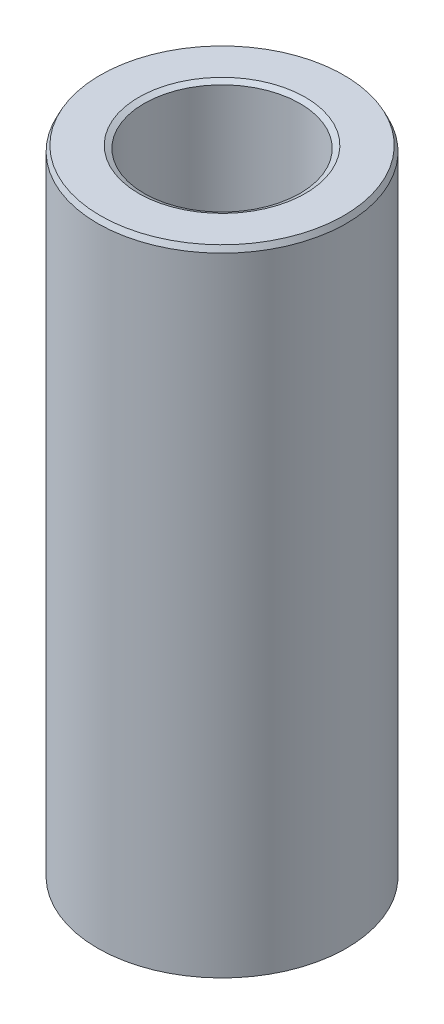
ISO-10303-21;
HEADER;
FILE_DESCRIPTION(('STEP AP214'),'2;1');
FILE_NAME('part.step','',(''),(''),'','','');
FILE_SCHEMA(('AUTOMOTIVE_DESIGN { 1 0 10303 214 1 1 1 1 }'));
ENDSEC;
DATA;
#1=APPLICATION_CONTEXT('core data for automotive mechanical design processes');
#2=APPLICATION_PROTOCOL_DEFINITION('international standard','automotive_design',2000,#1);
#3=PRODUCT_CONTEXT('',#1,'mechanical');
#4=PRODUCT('Part','Part','',(#3));
#5=PRODUCT_RELATED_PRODUCT_CATEGORY('part','',(#4));
#6=PRODUCT_DEFINITION_FORMATION('','',#4);
#7=PRODUCT_DEFINITION_CONTEXT('part definition',#1,'design');
#8=PRODUCT_DEFINITION('design','',#6,#7);
#9=PRODUCT_DEFINITION_SHAPE('','',#8);
#10=(LENGTH_UNIT() NAMED_UNIT(*) SI_UNIT(.MILLI.,.METRE.));
#11=(NAMED_UNIT(*) PLANE_ANGLE_UNIT() SI_UNIT($,.RADIAN.));
#12=(NAMED_UNIT(*) SI_UNIT($,.STERADIAN.) SOLID_ANGLE_UNIT());
#13=UNCERTAINTY_MEASURE_WITH_UNIT(LENGTH_MEASURE(1.E-05),#10,'distance_accuracy_value','');
#14=(GEOMETRIC_REPRESENTATION_CONTEXT(3) GLOBAL_UNCERTAINTY_ASSIGNED_CONTEXT((#13)) GLOBAL_UNIT_ASSIGNED_CONTEXT((#10,
#11,#12)) REPRESENTATION_CONTEXT('',''));
#15=CARTESIAN_POINT('',(0.,0.,0.));
#16=DIRECTION('',(0.,0.,1.));
#17=DIRECTION('',(1.,0.,0.));
#18=AXIS2_PLACEMENT_3D('',#15,#16,#17);
#19=CARTESIAN_POINT('',(0.,166.043960779627,0.));
#20=DIRECTION('',(0.,-1.,0.));
#21=DIRECTION('',(0.,0.,-1.));
#22=AXIS2_PLACEMENT_3D('',#19,#20,#21);
#23=CYLINDRICAL_SURFACE('',#22,32.5);
#24=CARTESIAN_POINT('',(0.,0.6985210400903,0.));
#25=DIRECTION('',(0.,1.,0.));
#26=DIRECTION('',(0.,0.,1.));
#27=AXIS2_PLACEMENT_3D('',#24,#25,#26);
#28=CIRCLE('',#27,32.5);
#29=CARTESIAN_POINT('',(0.,0.6985210400903,32.5));
#30=VERTEX_POINT('',#29);
#31=EDGE_CURVE('E10',#30,#30,#28,.T.);
#32=ORIENTED_EDGE('',*,*,#31,.T.);
#33=EDGE_LOOP('',(#32));
#34=FACE_BOUND('',#33,.T.);
#35=CARTESIAN_POINT('',(0.,164.63191108338,0.));
#36=DIRECTION('',(0.,1.,0.));
#37=DIRECTION('',(0.,0.,1.));
#38=AXIS2_PLACEMENT_3D('',#35,#36,#37);
#39=CIRCLE('',#38,32.5);
#40=CARTESIAN_POINT('',(0.,164.63191108338,32.5));
#41=VERTEX_POINT('',#40);
#42=EDGE_CURVE('E50',#41,#41,#39,.F.);
#43=ORIENTED_EDGE('',*,*,#42,.T.);
#44=EDGE_LOOP('',(#43));
#45=FACE_BOUND('',#44,.T.);
#46=ADVANCED_FACE('F39',(#34,#45),#23,.T.);
#47=CARTESIAN_POINT('',(0.,166.043960779627,0.));
#48=DIRECTION('',(0.,1.,0.));
#49=DIRECTION('',(0.,0.,1.));
#50=AXIS2_PLACEMENT_3D('',#47,#48,#49);
#51=PLANE('',#50);
#52=CARTESIAN_POINT('',(0.,166.043960779627,0.));
#53=DIRECTION('',(0.,1.,0.));
#54=DIRECTION('',(0.,0.,1.));
#55=AXIS2_PLACEMENT_3D('',#52,#53,#54);
#56=CIRCLE('',#55,21.7664873382776);
#57=CARTESIAN_POINT('',(0.,166.043960779627,21.7664873382776));
#58=VERTEX_POINT('',#57);
#59=EDGE_CURVE('E58',#58,#58,#56,.F.);
#60=ORIENTED_EDGE('',*,*,#59,.T.);
#61=EDGE_LOOP('',(#60));
#62=FACE_BOUND('',#61,.T.);
#63=CARTESIAN_POINT('',(0.,166.043960779627,0.));
#64=DIRECTION('',(0.,1.,0.));
#65=DIRECTION('',(0.,0.,1.));
#66=AXIS2_PLACEMENT_3D('',#63,#64,#65);
#67=CIRCLE('',#66,31.8014789599097);
#68=CARTESIAN_POINT('',(0.,166.043960779627,31.8014789599097));
#69=VERTEX_POINT('',#68);
#70=EDGE_CURVE('E61',#69,#69,#67,.T.);
#71=ORIENTED_EDGE('',*,*,#70,.T.);
#72=EDGE_LOOP('',(#71));
#73=FACE_BOUND('',#72,.T.);
#74=ADVANCED_FACE('F88',(#62,#73),#51,.T.);
#75=CARTESIAN_POINT('',(0.,0.,0.));
#76=DIRECTION('',(0.,1.,0.));
#77=DIRECTION('',(0.,0.,1.));
#78=AXIS2_PLACEMENT_3D('',#75,#76,#77);
#79=PLANE('',#78);
#80=CARTESIAN_POINT('',(0.,0.,0.));
#81=DIRECTION('',(0.,1.,0.));
#82=DIRECTION('',(0.,0.,1.));
#83=AXIS2_PLACEMENT_3D('',#80,#81,#82);
#84=CIRCLE('',#83,21.0529586821203);
#85=CARTESIAN_POINT('',(0.,0.,21.0529586821203));
#86=VERTEX_POINT('',#85);
#87=EDGE_CURVE('E51',#86,#86,#84,.T.);
#88=ORIENTED_EDGE('',*,*,#87,.T.);
#89=EDGE_LOOP('',(#88));
#90=FACE_BOUND('',#89,.T.);
#91=CARTESIAN_POINT('',(0.,0.,0.));
#92=DIRECTION('',(0.,1.,0.));
#93=DIRECTION('',(0.,0.,1.));
#94=AXIS2_PLACEMENT_3D('',#91,#92,#93);
#95=CIRCLE('',#94,31.0879503037524);
#96=CARTESIAN_POINT('',(0.,0.,31.0879503037524));
#97=VERTEX_POINT('',#96);
#98=EDGE_CURVE('E54',#97,#97,#95,.F.);
#99=ORIENTED_EDGE('',*,*,#98,.T.);
#100=EDGE_LOOP('',(#99));
#101=FACE_BOUND('',#100,.T.);
#102=ADVANCED_FACE('F83',(#90,#101),#79,.F.);
#103=CARTESIAN_POINT('',(0.,166.043960779627,0.));
#104=DIRECTION('',(0.,-1.,0.));
#105=DIRECTION('',(0.,0.,-1.));
#106=AXIS2_PLACEMENT_3D('',#103,#104,#105);
#107=CYLINDRICAL_SURFACE('',#106,20.35443764203);
#108=CARTESIAN_POINT('',(0.,165.345439739537,0.));
#109=DIRECTION('',(0.,1.,0.));
#110=DIRECTION('',(0.,0.,1.));
#111=AXIS2_PLACEMENT_3D('',#108,#109,#110);
#112=CIRCLE('',#111,20.35443764203);
#113=CARTESIAN_POINT('',(0.,165.345439739537,20.35443764203));
#114=VERTEX_POINT('',#113);
#115=EDGE_CURVE('E67',#114,#114,#112,.T.);
#116=ORIENTED_EDGE('',*,*,#115,.T.);
#117=EDGE_LOOP('',(#116));
#118=FACE_BOUND('',#117,.T.);
#119=CARTESIAN_POINT('',(0.,1.41204969624764,0.));
#120=DIRECTION('',(0.,1.,0.));
#121=DIRECTION('',(0.,0.,1.));
#122=AXIS2_PLACEMENT_3D('',#119,#120,#121);
#123=CIRCLE('',#122,20.35443764203);
#124=CARTESIAN_POINT('',(0.,1.41204969624764,20.35443764203));
#125=VERTEX_POINT('',#124);
#126=EDGE_CURVE('E69',#125,#125,#123,.F.);
#127=ORIENTED_EDGE('',*,*,#126,.T.);
#128=EDGE_LOOP('',(#127));
#129=FACE_BOUND('',#128,.T.);
#130=ADVANCED_FACE('F71',(#118,#129),#107,.F.);
#131=CARTESIAN_POINT('',(0.,165.345439739537,0.));
#132=DIRECTION('',(0.,1.,0.));
#133=DIRECTION('',(0.,0.,1.));
#134=AXIS2_PLACEMENT_3D('',#131,#132,#133);
#135=CONICAL_SURFACE('',#134,20.35443764203,1.11140904772631);
#136=ORIENTED_EDGE('',*,*,#59,.F.);
#137=EDGE_LOOP('',(#136));
#138=FACE_BOUND('',#137,.T.);
#139=ORIENTED_EDGE('',*,*,#115,.F.);
#140=EDGE_LOOP('',(#139));
#141=FACE_BOUND('',#140,.T.);
#142=ADVANCED_FACE('F77',(#138,#141),#135,.F.);
#143=CARTESIAN_POINT('',(0.,0.,0.));
#144=DIRECTION('',(0.,-1.,0.));
#145=DIRECTION('',(0.,0.,-1.));
#146=AXIS2_PLACEMENT_3D('',#143,#144,#145);
#147=CONICAL_SURFACE('',#146,21.0529586821203,0.459387279068585);
#148=ORIENTED_EDGE('',*,*,#126,.F.);
#149=EDGE_LOOP('',(#148));
#150=FACE_BOUND('',#149,.T.);
#151=ORIENTED_EDGE('',*,*,#87,.F.);
#152=EDGE_LOOP('',(#151));
#153=FACE_BOUND('',#152,.T.);
#154=ADVANCED_FACE('F73',(#150,#153),#147,.F.);
#155=CARTESIAN_POINT('',(0.,0.6985210400903,0.));
#156=DIRECTION('',(0.,1.,0.));
#157=DIRECTION('',(0.,0.,1.));
#158=AXIS2_PLACEMENT_3D('',#155,#156,#157);
#159=CONICAL_SURFACE('',#158,32.5,1.11140904772631);
#160=ORIENTED_EDGE('',*,*,#98,.F.);
#161=EDGE_LOOP('',(#160));
#162=FACE_BOUND('',#161,.T.);
#163=ORIENTED_EDGE('',*,*,#31,.F.);
#164=EDGE_LOOP('',(#163));
#165=FACE_BOUND('',#164,.T.);
#166=ADVANCED_FACE('F76',(#162,#165),#159,.T.);
#167=CARTESIAN_POINT('',(0.,166.043960779627,0.));
#168=DIRECTION('',(0.,-1.,0.));
#169=DIRECTION('',(0.,0.,-1.));
#170=AXIS2_PLACEMENT_3D('',#167,#168,#169);
#171=CONICAL_SURFACE('',#170,31.8014789599097,0.459387279068577);
#172=ORIENTED_EDGE('',*,*,#42,.F.);
#173=EDGE_LOOP('',(#172));
#174=FACE_BOUND('',#173,.T.);
#175=ORIENTED_EDGE('',*,*,#70,.F.);
#176=EDGE_LOOP('',(#175));
#177=FACE_BOUND('',#176,.T.);
#178=ADVANCED_FACE('F45',(#174,#177),#171,.T.);
#179=CLOSED_SHELL('',(#46,#74,#102,#130,#142,#154,#166,#178));
#180=MANIFOLD_SOLID_BREP('B2',#179);
#181=ADVANCED_BREP_SHAPE_REPRESENTATION('',(#18,#180),#14);
#182=SHAPE_DEFINITION_REPRESENTATION(#9,#181);
ENDSEC;
END-ISO-10303-21;
